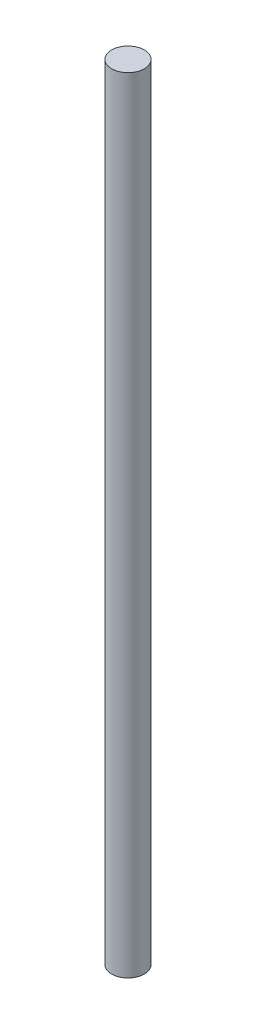
ISO-10303-21;
HEADER;
FILE_DESCRIPTION(('STEP AP214'),'2;1');
FILE_NAME('part.step','',(''),(''),'','','');
FILE_SCHEMA(('AUTOMOTIVE_DESIGN { 1 0 10303 214 1 1 1 1 }'));
ENDSEC;
DATA;
#1=APPLICATION_CONTEXT('core data for automotive mechanical design processes');
#2=APPLICATION_PROTOCOL_DEFINITION('international standard','automotive_design',2000,#1);
#3=PRODUCT_CONTEXT('',#1,'mechanical');
#4=PRODUCT('Part','Part','',(#3));
#5=PRODUCT_RELATED_PRODUCT_CATEGORY('part','',(#4));
#6=PRODUCT_DEFINITION_FORMATION('','',#4);
#7=PRODUCT_DEFINITION_CONTEXT('part definition',#1,'design');
#8=PRODUCT_DEFINITION('design','',#6,#7);
#9=PRODUCT_DEFINITION_SHAPE('','',#8);
#10=(LENGTH_UNIT() NAMED_UNIT(*) SI_UNIT(.MILLI.,.METRE.));
#11=(NAMED_UNIT(*) PLANE_ANGLE_UNIT() SI_UNIT($,.RADIAN.));
#12=(NAMED_UNIT(*) SI_UNIT($,.STERADIAN.) SOLID_ANGLE_UNIT());
#13=UNCERTAINTY_MEASURE_WITH_UNIT(LENGTH_MEASURE(1.E-05),#10,'distance_accuracy_value','');
#14=(GEOMETRIC_REPRESENTATION_CONTEXT(3) GLOBAL_UNCERTAINTY_ASSIGNED_CONTEXT((#13)) GLOBAL_UNIT_ASSIGNED_CONTEXT((#10,
#11,#12)) REPRESENTATION_CONTEXT('',''));
#15=CARTESIAN_POINT('',(0.,0.,0.));
#16=DIRECTION('',(0.,0.,1.));
#17=DIRECTION('',(1.,0.,0.));
#18=AXIS2_PLACEMENT_3D('',#15,#16,#17);
#19=CARTESIAN_POINT('',(0.,228.6,0.));
#20=DIRECTION('',(0.,-1.,0.));
#21=DIRECTION('',(0.,0.,-1.));
#22=AXIS2_PLACEMENT_3D('',#19,#20,#21);
#23=CYLINDRICAL_SURFACE('',#22,4.7625);
#24=CARTESIAN_POINT('',(0.,228.6,0.));
#25=DIRECTION('',(0.,1.,0.));
#26=DIRECTION('',(0.,0.,1.));
#27=AXIS2_PLACEMENT_3D('',#24,#25,#26);
#28=CIRCLE('',#27,4.7625);
#29=CARTESIAN_POINT('',(0.,228.6,4.7625));
#30=VERTEX_POINT('',#29);
#31=EDGE_CURVE('E10',#30,#30,#28,.T.);
#32=ORIENTED_EDGE('',*,*,#31,.F.);
#33=EDGE_LOOP('',(#32));
#34=FACE_BOUND('',#33,.T.);
#35=CARTESIAN_POINT('',(0.,0.,0.));
#36=DIRECTION('',(0.,1.,0.));
#37=DIRECTION('',(0.,0.,1.));
#38=AXIS2_PLACEMENT_3D('',#35,#36,#37);
#39=CIRCLE('',#38,4.7625);
#40=CARTESIAN_POINT('',(0.,0.,4.7625));
#41=VERTEX_POINT('',#40);
#42=EDGE_CURVE('E34',#41,#41,#39,.T.);
#43=ORIENTED_EDGE('',*,*,#42,.T.);
#44=EDGE_LOOP('',(#43));
#45=FACE_BOUND('',#44,.T.);
#46=ADVANCED_FACE('F31',(#34,#45),#23,.T.);
#47=CARTESIAN_POINT('',(0.,228.6,0.));
#48=DIRECTION('',(0.,1.,0.));
#49=DIRECTION('',(0.,0.,1.));
#50=AXIS2_PLACEMENT_3D('',#47,#48,#49);
#51=PLANE('',#50);
#52=ORIENTED_EDGE('',*,*,#31,.T.);
#53=EDGE_LOOP('',(#52));
#54=FACE_BOUND('',#53,.T.);
#55=ADVANCED_FACE('F46',(#54),#51,.T.);
#56=CARTESIAN_POINT('',(0.,0.,0.));
#57=DIRECTION('',(0.,1.,0.));
#58=DIRECTION('',(0.,0.,1.));
#59=AXIS2_PLACEMENT_3D('',#56,#57,#58);
#60=PLANE('',#59);
#61=ORIENTED_EDGE('',*,*,#42,.F.);
#62=EDGE_LOOP('',(#61));
#63=FACE_BOUND('',#62,.T.);
#64=ADVANCED_FACE('F44',(#63),#60,.F.);
#65=CLOSED_SHELL('',(#46,#55,#64));
#66=MANIFOLD_SOLID_BREP('B2',#65);
#67=ADVANCED_BREP_SHAPE_REPRESENTATION('',(#18,#66),#14);
#68=SHAPE_DEFINITION_REPRESENTATION(#9,#67);
ENDSEC;
END-ISO-10303-21;
